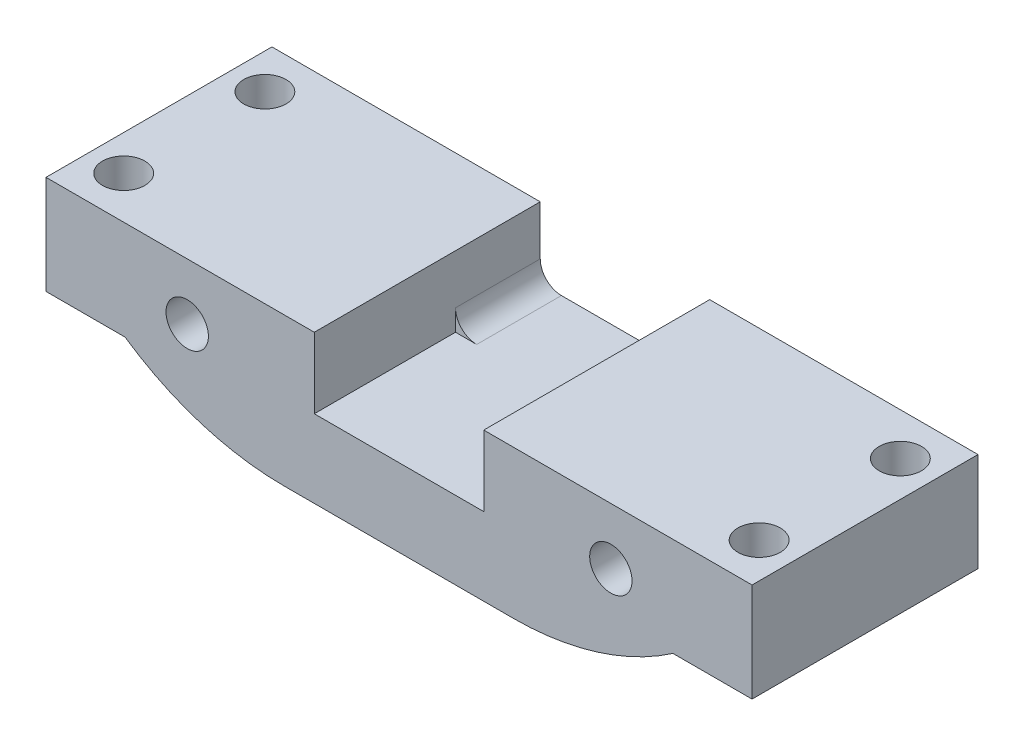
ISO-10303-21;
HEADER;
FILE_DESCRIPTION(('STEP AP214'),'2;1');
FILE_NAME('part.step','',(''),(''),'','','');
FILE_SCHEMA(('AUTOMOTIVE_DESIGN { 1 0 10303 214 1 1 1 1 }'));
ENDSEC;
DATA;
#1=APPLICATION_CONTEXT('core data for automotive mechanical design processes');
#2=APPLICATION_PROTOCOL_DEFINITION('international standard','automotive_design',2000,#1);
#3=PRODUCT_CONTEXT('',#1,'mechanical');
#4=PRODUCT('Part','Part','',(#3));
#5=PRODUCT_RELATED_PRODUCT_CATEGORY('part','',(#4));
#6=PRODUCT_DEFINITION_FORMATION('','',#4);
#7=PRODUCT_DEFINITION_CONTEXT('part definition',#1,'design');
#8=PRODUCT_DEFINITION('design','',#6,#7);
#9=PRODUCT_DEFINITION_SHAPE('','',#8);
#10=(LENGTH_UNIT() NAMED_UNIT(*) SI_UNIT(.MILLI.,.METRE.));
#11=(NAMED_UNIT(*) PLANE_ANGLE_UNIT() SI_UNIT($,.RADIAN.));
#12=(NAMED_UNIT(*) SI_UNIT($,.STERADIAN.) SOLID_ANGLE_UNIT());
#13=UNCERTAINTY_MEASURE_WITH_UNIT(LENGTH_MEASURE(1.E-05),#10,'distance_accuracy_value','');
#14=(GEOMETRIC_REPRESENTATION_CONTEXT(3) GLOBAL_UNCERTAINTY_ASSIGNED_CONTEXT((#13)) GLOBAL_UNIT_ASSIGNED_CONTEXT((#10,
#11,#12)) REPRESENTATION_CONTEXT('',''));
#15=CARTESIAN_POINT('',(0.,0.,0.));
#16=DIRECTION('',(0.,0.,1.));
#17=DIRECTION('',(1.,0.,0.));
#18=AXIS2_PLACEMENT_3D('',#15,#16,#17);
#19=CARTESIAN_POINT('',(0.,14.9,10.));
#20=DIRECTION('',(0.,1.,0.));
#21=DIRECTION('',(-1.,0.,0.));
#22=AXIS2_PLACEMENT_3D('',#19,#20,#21);
#23=PLANE('',#22);
#24=CARTESIAN_POINT('',(45.5,14.9,7.));
#25=DIRECTION('',(0.,1.,0.));
#26=DIRECTION('',(-1.,0.,0.));
#27=AXIS2_PLACEMENT_3D('',#24,#25,#26);
#28=CIRCLE('',#27,1.5);
#29=CARTESIAN_POINT('',(44.,14.9,7.));
#30=VERTEX_POINT('',#29);
#31=EDGE_CURVE('E297',#30,#30,#28,.T.);
#32=ORIENTED_EDGE('',*,*,#31,.F.);
#33=EDGE_LOOP('',(#32));
#34=FACE_BOUND('',#33,.T.);
#35=CARTESIAN_POINT('',(45.4999999999999,14.9,-3.00000000000001));
#36=DIRECTION('',(0.,1.,0.));
#37=DIRECTION('',(-1.,0.,0.));
#38=AXIS2_PLACEMENT_3D('',#35,#36,#37);
#39=CIRCLE('',#38,1.5);
#40=CARTESIAN_POINT('',(43.9999999999999,14.9,-3.00000000000001));
#41=VERTEX_POINT('',#40);
#42=EDGE_CURVE('E294',#41,#41,#39,.T.);
#43=ORIENTED_EDGE('',*,*,#42,.F.);
#44=EDGE_LOOP('',(#43));
#45=FACE_BOUND('',#44,.T.);
#46=DIRECTION('',(0.,0.,-1.));
#47=VECTOR('',#46,1.);
#48=CARTESIAN_POINT('',(48.,14.9,10.));
#49=LINE('',#48,#47);
#50=CARTESIAN_POINT('',(48.,14.9,10.));
#51=VERTEX_POINT('',#50);
#52=CARTESIAN_POINT('',(48.,14.9,-6.));
#53=VERTEX_POINT('',#52);
#54=EDGE_CURVE('E166',#51,#53,#49,.T.);
#55=ORIENTED_EDGE('',*,*,#54,.T.);
#56=DIRECTION('',(1.,0.,0.));
#57=VECTOR('',#56,1.);
#58=CARTESIAN_POINT('',(29.,14.9,-6.));
#59=LINE('',#58,#57);
#60=CARTESIAN_POINT('',(29.,14.9,-6.));
#61=VERTEX_POINT('',#60);
#62=EDGE_CURVE('E182',#61,#53,#59,.T.);
#63=ORIENTED_EDGE('',*,*,#62,.F.);
#64=DIRECTION('',(0.,0.,-1.));
#65=VECTOR('',#64,1.);
#66=CARTESIAN_POINT('',(29.,14.9,10.));
#67=LINE('',#66,#65);
#68=CARTESIAN_POINT('',(29.,14.9,10.));
#69=VERTEX_POINT('',#68);
#70=EDGE_CURVE('E285',#69,#61,#67,.T.);
#71=ORIENTED_EDGE('',*,*,#70,.F.);
#72=DIRECTION('',(1.,0.,0.));
#73=VECTOR('',#72,1.);
#74=CARTESIAN_POINT('',(0.,14.9,10.));
#75=LINE('',#74,#73);
#76=EDGE_CURVE('E239',#69,#51,#75,.T.);
#77=ORIENTED_EDGE('',*,*,#76,.T.);
#78=EDGE_LOOP('',(#55,#63,#71,#77));
#79=FACE_BOUND('',#78,.T.);
#80=ADVANCED_FACE('F41',(#34,#45,#79),#23,.T.);
#81=CARTESIAN_POINT('',(29.,0.,10.));
#82=DIRECTION('',(1.,0.,0.));
#83=DIRECTION('',(0.,0.,-1.));
#84=AXIS2_PLACEMENT_3D('',#81,#82,#83);
#85=PLANE('',#84);
#86=ORIENTED_EDGE('',*,*,#70,.T.);
#87=DIRECTION('',(0.,1.,0.));
#88=VECTOR('',#87,1.);
#89=CARTESIAN_POINT('',(29.,11.4,-6.));
#90=LINE('',#89,#88);
#91=CARTESIAN_POINT('',(29.,11.4,-6.));
#92=VERTEX_POINT('',#91);
#93=EDGE_CURVE('E216',#92,#61,#90,.T.);
#94=ORIENTED_EDGE('',*,*,#93,.F.);
#95=DIRECTION('',(0.,0.,1.));
#96=VECTOR('',#95,1.);
#97=CARTESIAN_POINT('',(29.,11.4,-6.));
#98=LINE('',#97,#96);
#99=CARTESIAN_POINT('',(29.,11.4,0.));
#100=VERTEX_POINT('',#99);
#101=EDGE_CURVE('E219',#92,#100,#98,.T.);
#102=ORIENTED_EDGE('',*,*,#101,.T.);
#103=DIRECTION('',(0.,-1.,0.));
#104=VECTOR('',#103,1.);
#105=CARTESIAN_POINT('',(29.,0.,0.));
#106=LINE('',#105,#104);
#107=CARTESIAN_POINT('',(29.,9.9,0.));
#108=VERTEX_POINT('',#107);
#109=EDGE_CURVE('E231',#100,#108,#106,.T.);
#110=ORIENTED_EDGE('',*,*,#109,.T.);
#111=DIRECTION('',(0.,0.,-1.));
#112=VECTOR('',#111,1.);
#113=CARTESIAN_POINT('',(29.,9.9,10.));
#114=LINE('',#113,#112);
#115=CARTESIAN_POINT('',(29.,9.9,10.));
#116=VERTEX_POINT('',#115);
#117=EDGE_CURVE('E282',#116,#108,#114,.T.);
#118=ORIENTED_EDGE('',*,*,#117,.F.);
#119=DIRECTION('',(0.,-1.,0.));
#120=VECTOR('',#119,1.);
#121=CARTESIAN_POINT('',(29.,0.,10.));
#122=LINE('',#121,#120);
#123=EDGE_CURVE('E242',#69,#116,#122,.T.);
#124=ORIENTED_EDGE('',*,*,#123,.F.);
#125=EDGE_LOOP('',(#86,#94,#102,#110,#118,#124));
#126=FACE_BOUND('',#125,.T.);
#127=ADVANCED_FACE('F338',(#126),#85,.F.);
#128=CARTESIAN_POINT('',(0.,9.9,10.));
#129=DIRECTION('',(0.,1.,0.));
#130=DIRECTION('',(0.,0.,1.));
#131=AXIS2_PLACEMENT_3D('',#128,#129,#130);
#132=PLANE('',#131);
#133=DIRECTION('',(1.,0.,0.));
#134=VECTOR('',#133,1.);
#135=CARTESIAN_POINT('',(0.,9.9,0.));
#136=LINE('',#135,#134);
#137=CARTESIAN_POINT('',(17.,9.9,0.));
#138=VERTEX_POINT('',#137);
#139=CARTESIAN_POINT('',(18.5,9.9,0.));
#140=VERTEX_POINT('',#139);
#141=EDGE_CURVE('E266',#138,#140,#136,.T.);
#142=ORIENTED_EDGE('',*,*,#141,.F.);
#143=DIRECTION('',(0.,0.,-1.));
#144=VECTOR('',#143,1.);
#145=CARTESIAN_POINT('',(17.,9.9,10.));
#146=LINE('',#145,#144);
#147=CARTESIAN_POINT('',(17.,9.9,10.));
#148=VERTEX_POINT('',#147);
#149=EDGE_CURVE('E279',#148,#138,#146,.T.);
#150=ORIENTED_EDGE('',*,*,#149,.F.);
#151=DIRECTION('',(1.,0.,0.));
#152=VECTOR('',#151,1.);
#153=CARTESIAN_POINT('',(0.,9.9,10.));
#154=LINE('',#153,#152);
#155=EDGE_CURVE('E244',#148,#116,#154,.T.);
#156=ORIENTED_EDGE('',*,*,#155,.T.);
#157=ORIENTED_EDGE('',*,*,#117,.T.);
#158=CARTESIAN_POINT('',(27.5,9.9,0.));
#159=VERTEX_POINT('',#158);
#160=EDGE_CURVE('E265',#159,#108,#136,.T.);
#161=ORIENTED_EDGE('',*,*,#160,.F.);
#162=DIRECTION('',(0.,0.,1.));
#163=VECTOR('',#162,1.);
#164=CARTESIAN_POINT('',(27.5,9.9,-6.));
#165=LINE('',#164,#163);
#166=CARTESIAN_POINT('',(27.5,9.9,-6.));
#167=VERTEX_POINT('',#166);
#168=EDGE_CURVE('E224',#167,#159,#165,.T.);
#169=ORIENTED_EDGE('',*,*,#168,.F.);
#170=DIRECTION('',(1.,0.,0.));
#171=VECTOR('',#170,1.);
#172=CARTESIAN_POINT('',(18.5,9.9,-6.));
#173=LINE('',#172,#171);
#174=CARTESIAN_POINT('',(18.5,9.9,-6.));
#175=VERTEX_POINT('',#174);
#176=EDGE_CURVE('E212',#175,#167,#173,.T.);
#177=ORIENTED_EDGE('',*,*,#176,.F.);
#178=DIRECTION('',(0.,0.,1.));
#179=VECTOR('',#178,1.);
#180=CARTESIAN_POINT('',(18.5,9.9,-6.));
#181=LINE('',#180,#179);
#182=EDGE_CURVE('E226',#175,#140,#181,.T.);
#183=ORIENTED_EDGE('',*,*,#182,.T.);
#184=EDGE_LOOP('',(#142,#150,#156,#157,#161,#169,#177,#183));
#185=FACE_BOUND('',#184,.T.);
#186=ADVANCED_FACE('F344',(#185),#132,.T.);
#187=CARTESIAN_POINT('',(17.,0.,10.));
#188=DIRECTION('',(1.,0.,0.));
#189=DIRECTION('',(0.,0.,-1.));
#190=AXIS2_PLACEMENT_3D('',#187,#188,#189);
#191=PLANE('',#190);
#192=DIRECTION('',(0.,-1.,0.));
#193=VECTOR('',#192,1.);
#194=CARTESIAN_POINT('',(17.,0.,0.));
#195=LINE('',#194,#193);
#196=CARTESIAN_POINT('',(17.,11.4,0.));
#197=VERTEX_POINT('',#196);
#198=EDGE_CURVE('E236',#197,#138,#195,.T.);
#199=ORIENTED_EDGE('',*,*,#198,.F.);
#200=DIRECTION('',(0.,0.,1.));
#201=VECTOR('',#200,1.);
#202=CARTESIAN_POINT('',(17.,11.4,-6.));
#203=LINE('',#202,#201);
#204=CARTESIAN_POINT('',(17.,11.4,-6.));
#205=VERTEX_POINT('',#204);
#206=EDGE_CURVE('E229',#205,#197,#203,.T.);
#207=ORIENTED_EDGE('',*,*,#206,.F.);
#208=DIRECTION('',(0.,-1.,0.));
#209=VECTOR('',#208,1.);
#210=CARTESIAN_POINT('',(17.,14.9,-6.));
#211=LINE('',#210,#209);
#212=CARTESIAN_POINT('',(17.,14.9,-6.));
#213=VERTEX_POINT('',#212);
#214=EDGE_CURVE('E208',#213,#205,#211,.T.);
#215=ORIENTED_EDGE('',*,*,#214,.F.);
#216=DIRECTION('',(0.,0.,-1.));
#217=VECTOR('',#216,1.);
#218=CARTESIAN_POINT('',(17.,14.9,10.));
#219=LINE('',#218,#217);
#220=CARTESIAN_POINT('',(17.,14.9,10.));
#221=VERTEX_POINT('',#220);
#222=EDGE_CURVE('E277',#221,#213,#219,.T.);
#223=ORIENTED_EDGE('',*,*,#222,.F.);
#224=DIRECTION('',(0.,-1.,0.));
#225=VECTOR('',#224,1.);
#226=CARTESIAN_POINT('',(17.,0.,10.));
#227=LINE('',#226,#225);
#228=EDGE_CURVE('E247',#221,#148,#227,.T.);
#229=ORIENTED_EDGE('',*,*,#228,.T.);
#230=ORIENTED_EDGE('',*,*,#149,.T.);
#231=EDGE_LOOP('',(#199,#207,#215,#223,#229,#230));
#232=FACE_BOUND('',#231,.T.);
#233=ADVANCED_FACE('F387',(#232),#191,.T.);
#234=CARTESIAN_POINT('',(0.,14.9,10.));
#235=DIRECTION('',(0.,1.,0.));
#236=DIRECTION('',(-1.,0.,0.));
#237=AXIS2_PLACEMENT_3D('',#234,#235,#236);
#238=PLANE('',#237);
#239=CARTESIAN_POINT('',(0.499999999999979,14.9,-3.));
#240=DIRECTION('',(0.,1.,0.));
#241=DIRECTION('',(-1.,0.,0.));
#242=AXIS2_PLACEMENT_3D('',#239,#240,#241);
#243=CIRCLE('',#242,1.5);
#244=CARTESIAN_POINT('',(-1.00000000000002,14.9,-3.));
#245=VERTEX_POINT('',#244);
#246=EDGE_CURVE('E311',#245,#245,#243,.T.);
#247=ORIENTED_EDGE('',*,*,#246,.F.);
#248=EDGE_LOOP('',(#247));
#249=FACE_BOUND('',#248,.T.);
#250=CARTESIAN_POINT('',(0.499999999999975,14.9,7.));
#251=DIRECTION('',(0.,1.,0.));
#252=DIRECTION('',(-1.,0.,0.));
#253=AXIS2_PLACEMENT_3D('',#250,#251,#252);
#254=CIRCLE('',#253,1.5);
#255=CARTESIAN_POINT('',(-1.00000000000002,14.9,7.));
#256=VERTEX_POINT('',#255);
#257=EDGE_CURVE('E300',#256,#256,#254,.T.);
#258=ORIENTED_EDGE('',*,*,#257,.F.);
#259=EDGE_LOOP('',(#258));
#260=FACE_BOUND('',#259,.T.);
#261=ORIENTED_EDGE('',*,*,#222,.T.);
#262=DIRECTION('',(1.,0.,0.));
#263=VECTOR('',#262,1.);
#264=CARTESIAN_POINT('',(-2.00000000000002,14.9,-6.));
#265=LINE('',#264,#263);
#266=CARTESIAN_POINT('',(-2.00000000000002,14.9,-6.));
#267=VERTEX_POINT('',#266);
#268=EDGE_CURVE('E205',#267,#213,#265,.T.);
#269=ORIENTED_EDGE('',*,*,#268,.F.);
#270=DIRECTION('',(0.,0.,-1.));
#271=VECTOR('',#270,1.);
#272=CARTESIAN_POINT('',(-2.00000000000002,14.9,10.));
#273=LINE('',#272,#271);
#274=CARTESIAN_POINT('',(-2.00000000000002,14.9,10.));
#275=VERTEX_POINT('',#274);
#276=EDGE_CURVE('E275',#275,#267,#273,.T.);
#277=ORIENTED_EDGE('',*,*,#276,.F.);
#278=DIRECTION('',(1.,0.,0.));
#279=VECTOR('',#278,1.);
#280=CARTESIAN_POINT('',(0.,14.9,10.));
#281=LINE('',#280,#279);
#282=EDGE_CURVE('E250',#275,#221,#281,.T.);
#283=ORIENTED_EDGE('',*,*,#282,.T.);
#284=EDGE_LOOP('',(#261,#269,#277,#283));
#285=FACE_BOUND('',#284,.T.);
#286=ADVANCED_FACE('F383',(#249,#260,#285),#238,.T.);
#287=CARTESIAN_POINT('',(-2.00000000000002,0.,10.));
#288=DIRECTION('',(1.,0.,0.));
#289=DIRECTION('',(0.,1.,0.));
#290=AXIS2_PLACEMENT_3D('',#287,#288,#289);
#291=PLANE('',#290);
#292=ORIENTED_EDGE('',*,*,#276,.T.);
#293=DIRECTION('',(0.,1.,0.));
#294=VECTOR('',#293,1.);
#295=CARTESIAN_POINT('',(-2.00000000000002,7.9,-6.));
#296=LINE('',#295,#294);
#297=CARTESIAN_POINT('',(-2.00000000000002,7.9,-6.));
#298=VERTEX_POINT('',#297);
#299=EDGE_CURVE('E202',#298,#267,#296,.T.);
#300=ORIENTED_EDGE('',*,*,#299,.F.);
#301=DIRECTION('',(0.,0.,-1.));
#302=VECTOR('',#301,1.);
#303=CARTESIAN_POINT('',(-2.00000000000002,7.9,10.));
#304=LINE('',#303,#302);
#305=CARTESIAN_POINT('',(-2.00000000000002,7.9,10.));
#306=VERTEX_POINT('',#305);
#307=EDGE_CURVE('E273',#306,#298,#304,.T.);
#308=ORIENTED_EDGE('',*,*,#307,.F.);
#309=DIRECTION('',(0.,-1.,0.));
#310=VECTOR('',#309,1.);
#311=CARTESIAN_POINT('',(-2.00000000000002,0.,10.));
#312=LINE('',#311,#310);
#313=EDGE_CURVE('E253',#275,#306,#312,.T.);
#314=ORIENTED_EDGE('',*,*,#313,.F.);
#315=EDGE_LOOP('',(#292,#300,#308,#314));
#316=FACE_BOUND('',#315,.T.);
#317=ADVANCED_FACE('F378',(#316),#291,.F.);
#318=CARTESIAN_POINT('',(0.,7.9,10.));
#319=DIRECTION('',(0.,-1.,0.));
#320=DIRECTION('',(0.,0.,-1.));
#321=AXIS2_PLACEMENT_3D('',#318,#319,#320);
#322=PLANE('',#321);
#323=CARTESIAN_POINT('',(0.499999999999981,7.9,-3.));
#324=DIRECTION('',(0.,-1.,0.));
#325=DIRECTION('',(0.,0.,-1.));
#326=AXIS2_PLACEMENT_3D('',#323,#324,#325);
#327=CIRCLE('',#326,1.5);
#328=CARTESIAN_POINT('',(0.499999999999981,7.9,-4.5));
#329=VERTEX_POINT('',#328);
#330=EDGE_CURVE('E45',#329,#329,#327,.T.);
#331=ORIENTED_EDGE('',*,*,#330,.F.);
#332=EDGE_LOOP('',(#331));
#333=FACE_BOUND('',#332,.T.);
#334=CARTESIAN_POINT('',(0.499999999999977,7.9,7.));
#335=DIRECTION('',(0.,-1.,0.));
#336=DIRECTION('',(0.,0.,-1.));
#337=AXIS2_PLACEMENT_3D('',#334,#335,#336);
#338=CIRCLE('',#337,1.5);
#339=CARTESIAN_POINT('',(0.499999999999977,7.9,5.5));
#340=VERTEX_POINT('',#339);
#341=EDGE_CURVE('E298',#340,#340,#338,.T.);
#342=ORIENTED_EDGE('',*,*,#341,.F.);
#343=EDGE_LOOP('',(#342));
#344=FACE_BOUND('',#343,.T.);
#345=ORIENTED_EDGE('',*,*,#307,.T.);
#346=DIRECTION('',(-1.,0.,0.));
#347=VECTOR('',#346,1.);
#348=CARTESIAN_POINT('',(3.5980762113533,7.90000000000001,-6.));
#349=LINE('',#348,#347);
#350=CARTESIAN_POINT('',(3.5980762113533,7.90000000000001,-6.));
#351=VERTEX_POINT('',#350);
#352=EDGE_CURVE('E199',#351,#298,#349,.T.);
#353=ORIENTED_EDGE('',*,*,#352,.F.);
#354=DIRECTION('',(0.,0.,-1.));
#355=VECTOR('',#354,1.);
#356=CARTESIAN_POINT('',(3.5980762113533,7.9,10.));
#357=LINE('',#356,#355);
#358=CARTESIAN_POINT('',(3.5980762113533,7.9,10.));
#359=VERTEX_POINT('',#358);
#360=EDGE_CURVE('E271',#359,#351,#357,.T.);
#361=ORIENTED_EDGE('',*,*,#360,.F.);
#362=DIRECTION('',(-1.,0.,0.));
#363=VECTOR('',#362,1.);
#364=CARTESIAN_POINT('',(0.,7.9,10.));
#365=LINE('',#364,#363);
#366=EDGE_CURVE('E255',#359,#306,#365,.T.);
#367=ORIENTED_EDGE('',*,*,#366,.T.);
#368=EDGE_LOOP('',(#345,#353,#361,#367));
#369=FACE_BOUND('',#368,.T.);
#370=ADVANCED_FACE('F374',(#333,#344,#369),#322,.T.);
#371=CARTESIAN_POINT('',(0.,4.4,10.));
#372=DIRECTION('',(0.,1.,0.));
#373=DIRECTION('',(-1.,0.,0.));
#374=AXIS2_PLACEMENT_3D('',#371,#372,#373);
#375=PLANE('',#374);
#376=DIRECTION('',(0.,0.,-1.));
#377=VECTOR('',#376,1.);
#378=CARTESIAN_POINT('',(14.9007307668106,4.40000000000001,10.));
#379=LINE('',#378,#377);
#380=CARTESIAN_POINT('',(14.9007307668106,4.40000000000001,10.));
#381=VERTEX_POINT('',#380);
#382=CARTESIAN_POINT('',(14.9007307668106,4.40000000000001,-6.));
#383=VERTEX_POINT('',#382);
#384=EDGE_CURVE('E287',#381,#383,#379,.T.);
#385=ORIENTED_EDGE('',*,*,#384,.T.);
#386=DIRECTION('',(-1.,0.,0.));
#387=VECTOR('',#386,1.);
#388=CARTESIAN_POINT('',(31.0973454445427,4.40000000000001,-6.));
#389=LINE('',#388,#387);
#390=CARTESIAN_POINT('',(31.0973454445427,4.40000000000001,-6.));
#391=VERTEX_POINT('',#390);
#392=EDGE_CURVE('E193',#391,#383,#389,.T.);
#393=ORIENTED_EDGE('',*,*,#392,.F.);
#394=DIRECTION('',(0.,0.,-1.));
#395=VECTOR('',#394,1.);
#396=CARTESIAN_POINT('',(31.0973454445427,4.40000000000001,10.));
#397=LINE('',#396,#395);
#398=CARTESIAN_POINT('',(31.0973454445427,4.40000000000001,10.));
#399=VERTEX_POINT('',#398);
#400=EDGE_CURVE('E58',#391,#399,#397,.F.);
#401=ORIENTED_EDGE('',*,*,#400,.T.);
#402=DIRECTION('',(1.,0.,0.));
#403=VECTOR('',#402,1.);
#404=CARTESIAN_POINT('',(0.,4.4,10.));
#405=LINE('',#404,#403);
#406=EDGE_CURVE('E258',#381,#399,#405,.T.);
#407=ORIENTED_EDGE('',*,*,#406,.F.);
#408=EDGE_LOOP('',(#385,#393,#401,#407));
#409=FACE_BOUND('',#408,.T.);
#410=ADVANCED_FACE('F369',(#409),#375,.F.);
#411=CARTESIAN_POINT('',(0.,7.9,10.));
#412=DIRECTION('',(0.,-1.,0.));
#413=DIRECTION('',(1.,0.,0.));
#414=AXIS2_PLACEMENT_3D('',#411,#412,#413);
#415=PLANE('',#414);
#416=CARTESIAN_POINT('',(45.5,7.90000000000001,7.));
#417=DIRECTION('',(0.,-1.,0.));
#418=DIRECTION('',(1.,0.,0.));
#419=AXIS2_PLACEMENT_3D('',#416,#417,#418);
#420=CIRCLE('',#419,1.5);
#421=CARTESIAN_POINT('',(47.,7.90000000000001,7.));
#422=VERTEX_POINT('',#421);
#423=EDGE_CURVE('E295',#422,#422,#420,.T.);
#424=ORIENTED_EDGE('',*,*,#423,.F.);
#425=EDGE_LOOP('',(#424));
#426=FACE_BOUND('',#425,.T.);
#427=CARTESIAN_POINT('',(45.4999999999999,7.90000000000001,-3.00000000000001));
#428=DIRECTION('',(0.,-1.,0.));
#429=DIRECTION('',(1.,0.,0.));
#430=AXIS2_PLACEMENT_3D('',#427,#428,#429);
#431=CIRCLE('',#430,1.5);
#432=CARTESIAN_POINT('',(46.9999999999999,7.90000000000001,-3.00000000000001));
#433=VERTEX_POINT('',#432);
#434=EDGE_CURVE('E291',#433,#433,#431,.T.);
#435=ORIENTED_EDGE('',*,*,#434,.F.);
#436=EDGE_LOOP('',(#435));
#437=FACE_BOUND('',#436,.T.);
#438=DIRECTION('',(0.,0.,-1.));
#439=VECTOR('',#438,1.);
#440=CARTESIAN_POINT('',(42.4,7.90000000000001,10.));
#441=LINE('',#440,#439);
#442=CARTESIAN_POINT('',(42.4,7.90000000000001,10.));
#443=VERTEX_POINT('',#442);
#444=CARTESIAN_POINT('',(42.4,7.90000000000001,-6.));
#445=VERTEX_POINT('',#444);
#446=EDGE_CURVE('E165',#443,#445,#441,.T.);
#447=ORIENTED_EDGE('',*,*,#446,.T.);
#448=DIRECTION('',(-1.,0.,0.));
#449=VECTOR('',#448,1.);
#450=CARTESIAN_POINT('',(48.,7.90000000000001,-6.));
#451=LINE('',#450,#449);
#452=CARTESIAN_POINT('',(48.,7.90000000000001,-6.));
#453=VERTEX_POINT('',#452);
#454=EDGE_CURVE('E169',#453,#445,#451,.T.);
#455=ORIENTED_EDGE('',*,*,#454,.F.);
#456=DIRECTION('',(0.,0.,-1.));
#457=VECTOR('',#456,1.);
#458=CARTESIAN_POINT('',(48.,7.90000000000001,10.));
#459=LINE('',#458,#457);
#460=CARTESIAN_POINT('',(48.,7.90000000000001,10.));
#461=VERTEX_POINT('',#460);
#462=EDGE_CURVE('E155',#461,#453,#459,.T.);
#463=ORIENTED_EDGE('',*,*,#462,.F.);
#464=DIRECTION('',(-1.,0.,0.));
#465=VECTOR('',#464,1.);
#466=CARTESIAN_POINT('',(0.,7.9,10.));
#467=LINE('',#466,#465);
#468=EDGE_CURVE('E260',#461,#443,#467,.T.);
#469=ORIENTED_EDGE('',*,*,#468,.T.);
#470=EDGE_LOOP('',(#447,#455,#463,#469));
#471=FACE_BOUND('',#470,.T.);
#472=ADVANCED_FACE('F170',(#426,#437,#471),#415,.T.);
#473=CARTESIAN_POINT('',(7.99999999999999,10.9,10.));
#474=DIRECTION('',(0.,0.,-1.));
#475=DIRECTION('',(-1.,0.,0.));
#476=AXIS2_PLACEMENT_3D('',#473,#474,#475);
#477=CYLINDRICAL_SURFACE('',#476,1.5);
#478=CARTESIAN_POINT('',(7.99999999999999,10.9,10.));
#479=DIRECTION('',(0.,0.,1.));
#480=DIRECTION('',(1.,0.,0.));
#481=AXIS2_PLACEMENT_3D('',#478,#479,#480);
#482=CIRCLE('',#481,1.5);
#483=CARTESIAN_POINT('',(9.49999999999998,10.9,10.));
#484=VERTEX_POINT('',#483);
#485=EDGE_CURVE('E235',#484,#484,#482,.T.);
#486=ORIENTED_EDGE('',*,*,#485,.T.);
#487=EDGE_LOOP('',(#486));
#488=FACE_BOUND('',#487,.T.);
#489=CARTESIAN_POINT('',(7.99999999999999,10.9,-6.));
#490=DIRECTION('',(0.,0.,-1.));
#491=DIRECTION('',(-1.,0.,0.));
#492=AXIS2_PLACEMENT_3D('',#489,#490,#491);
#493=CIRCLE('',#492,1.5);
#494=CARTESIAN_POINT('',(6.49999999999999,10.9,-6.));
#495=VERTEX_POINT('',#494);
#496=EDGE_CURVE('E313',#495,#495,#493,.T.);
#497=ORIENTED_EDGE('',*,*,#496,.T.);
#498=EDGE_LOOP('',(#497));
#499=FACE_BOUND('',#498,.T.);
#500=ADVANCED_FACE('F350',(#488,#499),#477,.F.);
#501=CARTESIAN_POINT('',(38.,10.9,10.));
#502=DIRECTION('',(0.,0.,-1.));
#503=DIRECTION('',(-1.,0.,0.));
#504=AXIS2_PLACEMENT_3D('',#501,#502,#503);
#505=CYLINDRICAL_SURFACE('',#504,1.5);
#506=CARTESIAN_POINT('',(38.,10.9,10.));
#507=DIRECTION('',(0.,0.,1.));
#508=DIRECTION('',(1.,0.,0.));
#509=AXIS2_PLACEMENT_3D('',#506,#507,#508);
#510=CIRCLE('',#509,1.5);
#511=CARTESIAN_POINT('',(39.5,10.9,10.));
#512=VERTEX_POINT('',#511);
#513=EDGE_CURVE('E232',#512,#512,#510,.T.);
#514=ORIENTED_EDGE('',*,*,#513,.T.);
#515=EDGE_LOOP('',(#514));
#516=FACE_BOUND('',#515,.T.);
#517=CARTESIAN_POINT('',(38.,10.9,-6.));
#518=DIRECTION('',(0.,0.,-1.));
#519=DIRECTION('',(-1.,0.,0.));
#520=AXIS2_PLACEMENT_3D('',#517,#518,#519);
#521=CIRCLE('',#520,1.5);
#522=CARTESIAN_POINT('',(36.5,10.9,-6.));
#523=VERTEX_POINT('',#522);
#524=EDGE_CURVE('E189',#523,#523,#521,.T.);
#525=ORIENTED_EDGE('',*,*,#524,.T.);
#526=EDGE_LOOP('',(#525));
#527=FACE_BOUND('',#526,.T.);
#528=ADVANCED_FACE('F320',(#516,#527),#505,.F.);
#529=CARTESIAN_POINT('',(48.,0.,10.));
#530=DIRECTION('',(1.,0.,0.));
#531=DIRECTION('',(0.,1.,0.));
#532=AXIS2_PLACEMENT_3D('',#529,#530,#531);
#533=PLANE('',#532);
#534=ORIENTED_EDGE('',*,*,#462,.T.);
#535=DIRECTION('',(0.,-1.,0.));
#536=VECTOR('',#535,1.);
#537=CARTESIAN_POINT('',(48.,14.9,-6.));
#538=LINE('',#537,#536);
#539=EDGE_CURVE('E159',#53,#453,#538,.T.);
#540=ORIENTED_EDGE('',*,*,#539,.F.);
#541=ORIENTED_EDGE('',*,*,#54,.F.);
#542=DIRECTION('',(0.,-1.,0.));
#543=VECTOR('',#542,1.);
#544=CARTESIAN_POINT('',(48.,0.,10.));
#545=LINE('',#544,#543);
#546=EDGE_CURVE('E161',#51,#461,#545,.T.);
#547=ORIENTED_EDGE('',*,*,#546,.T.);
#548=EDGE_LOOP('',(#534,#540,#541,#547));
#549=FACE_BOUND('',#548,.T.);
#550=ADVANCED_FACE('F157',(#549),#533,.T.);
#551=CARTESIAN_POINT('',(0.,0.,10.));
#552=DIRECTION('',(0.,0.,1.));
#553=DIRECTION('',(1.,0.,0.));
#554=AXIS2_PLACEMENT_3D('',#551,#552,#553);
#555=PLANE('',#554);
#556=ORIENTED_EDGE('',*,*,#513,.F.);
#557=EDGE_LOOP('',(#556));
#558=FACE_BOUND('',#557,.T.);
#559=ORIENTED_EDGE('',*,*,#485,.F.);
#560=EDGE_LOOP('',(#559));
#561=FACE_BOUND('',#560,.T.);
#562=ORIENTED_EDGE('',*,*,#406,.T.);
#563=CARTESIAN_POINT('',(31.0973454445427,24.4,10.));
#564=DIRECTION('',(0.,0.,1.));
#565=DIRECTION('',(1.,0.,0.));
#566=AXIS2_PLACEMENT_3D('',#563,#564,#565);
#567=CIRCLE('',#566,20.);
#568=EDGE_CURVE('E11',#399,#443,#567,.T.);
#569=ORIENTED_EDGE('',*,*,#568,.T.);
#570=ORIENTED_EDGE('',*,*,#468,.F.);
#571=ORIENTED_EDGE('',*,*,#546,.F.);
#572=ORIENTED_EDGE('',*,*,#76,.F.);
#573=ORIENTED_EDGE('',*,*,#123,.T.);
#574=ORIENTED_EDGE('',*,*,#155,.F.);
#575=ORIENTED_EDGE('',*,*,#228,.F.);
#576=ORIENTED_EDGE('',*,*,#282,.F.);
#577=ORIENTED_EDGE('',*,*,#313,.T.);
#578=ORIENTED_EDGE('',*,*,#366,.F.);
#579=CARTESIAN_POINT('',(14.9007307668106,24.4,10.));
#580=DIRECTION('',(0.,0.,1.));
#581=DIRECTION('',(1.,0.,0.));
#582=AXIS2_PLACEMENT_3D('',#579,#580,#581);
#583=CIRCLE('',#582,20.);
#584=EDGE_CURVE('E50',#359,#381,#583,.T.);
#585=ORIENTED_EDGE('',*,*,#584,.T.);
#586=EDGE_LOOP('',(#562,#569,#570,#571,#572,#573,#574,#575,#576,#577,#578,#585));
#587=FACE_BOUND('',#586,.T.);
#588=ADVANCED_FACE('F358',(#558,#561,#587),#555,.T.);
#589=CARTESIAN_POINT('',(31.0973454445427,24.4,10.));
#590=DIRECTION('',(0.,0.,-1.));
#591=DIRECTION('',(-1.,0.,0.));
#592=AXIS2_PLACEMENT_3D('',#589,#590,#591);
#593=CYLINDRICAL_SURFACE('',#592,20.);
#594=ORIENTED_EDGE('',*,*,#568,.F.);
#595=ORIENTED_EDGE('',*,*,#400,.F.);
#596=CARTESIAN_POINT('',(31.0973454445427,24.4,-6.));
#597=DIRECTION('',(0.,0.,-1.));
#598=DIRECTION('',(-1.,0.,0.));
#599=AXIS2_PLACEMENT_3D('',#596,#597,#598);
#600=CIRCLE('',#599,20.);
#601=EDGE_CURVE('E175',#445,#391,#600,.T.);
#602=ORIENTED_EDGE('',*,*,#601,.F.);
#603=ORIENTED_EDGE('',*,*,#446,.F.);
#604=EDGE_LOOP('',(#594,#595,#602,#603));
#605=FACE_BOUND('',#604,.T.);
#606=ADVANCED_FACE('F356',(#605),#593,.T.);
#607=CARTESIAN_POINT('',(14.9007307668106,24.4,10.));
#608=DIRECTION('',(0.,0.,-1.));
#609=DIRECTION('',(-1.,0.,0.));
#610=AXIS2_PLACEMENT_3D('',#607,#608,#609);
#611=CYLINDRICAL_SURFACE('',#610,20.);
#612=ORIENTED_EDGE('',*,*,#584,.F.);
#613=ORIENTED_EDGE('',*,*,#360,.T.);
#614=CARTESIAN_POINT('',(14.9007307668106,24.4,-6.));
#615=DIRECTION('',(0.,0.,-1.));
#616=DIRECTION('',(-1.,0.,0.));
#617=AXIS2_PLACEMENT_3D('',#614,#615,#616);
#618=CIRCLE('',#617,20.);
#619=EDGE_CURVE('E196',#383,#351,#618,.T.);
#620=ORIENTED_EDGE('',*,*,#619,.F.);
#621=ORIENTED_EDGE('',*,*,#384,.F.);
#622=EDGE_LOOP('',(#612,#613,#620,#621));
#623=FACE_BOUND('',#622,.T.);
#624=ADVANCED_FACE('F43',(#623),#611,.T.);
#625=CARTESIAN_POINT('',(31.0973454445427,24.4,0.));
#626=DIRECTION('',(0.,0.,-1.));
#627=DIRECTION('',(-1.,0.,0.));
#628=AXIS2_PLACEMENT_3D('',#625,#626,#627);
#629=PLANE('',#628);
#630=CARTESIAN_POINT('',(18.5,11.4,0.));
#631=DIRECTION('',(0.,0.,1.));
#632=DIRECTION('',(-1.,0.,0.));
#633=AXIS2_PLACEMENT_3D('',#630,#631,#632);
#634=CIRCLE('',#633,1.5);
#635=EDGE_CURVE('E186',#197,#140,#634,.T.);
#636=ORIENTED_EDGE('',*,*,#635,.F.);
#637=ORIENTED_EDGE('',*,*,#198,.T.);
#638=ORIENTED_EDGE('',*,*,#141,.T.);
#639=EDGE_LOOP('',(#636,#637,#638));
#640=FACE_BOUND('',#639,.T.);
#641=ADVANCED_FACE('F333',(#640),#629,.F.);
#642=CARTESIAN_POINT('',(27.5,11.4,0.));
#643=DIRECTION('',(0.,0.,1.));
#644=DIRECTION('',(-1.,0.,0.));
#645=AXIS2_PLACEMENT_3D('',#642,#643,#644);
#646=CIRCLE('',#645,1.5);
#647=EDGE_CURVE('E183',#159,#100,#646,.T.);
#648=ORIENTED_EDGE('',*,*,#647,.F.);
#649=ORIENTED_EDGE('',*,*,#160,.T.);
#650=ORIENTED_EDGE('',*,*,#109,.F.);
#651=EDGE_LOOP('',(#648,#649,#650));
#652=FACE_BOUND('',#651,.T.);
#653=ADVANCED_FACE('F324',(#652),#629,.F.);
#654=CARTESIAN_POINT('',(31.0973454445427,24.4,-6.));
#655=DIRECTION('',(0.,0.,-1.));
#656=DIRECTION('',(-1.,0.,0.));
#657=AXIS2_PLACEMENT_3D('',#654,#655,#656);
#658=PLANE('',#657);
#659=ORIENTED_EDGE('',*,*,#524,.F.);
#660=EDGE_LOOP('',(#659));
#661=FACE_BOUND('',#660,.T.);
#662=ORIENTED_EDGE('',*,*,#539,.T.);
#663=ORIENTED_EDGE('',*,*,#454,.T.);
#664=ORIENTED_EDGE('',*,*,#601,.T.);
#665=ORIENTED_EDGE('',*,*,#392,.T.);
#666=ORIENTED_EDGE('',*,*,#619,.T.);
#667=ORIENTED_EDGE('',*,*,#352,.T.);
#668=ORIENTED_EDGE('',*,*,#299,.T.);
#669=ORIENTED_EDGE('',*,*,#268,.T.);
#670=ORIENTED_EDGE('',*,*,#214,.T.);
#671=CARTESIAN_POINT('',(18.5,11.4,-6.));
#672=DIRECTION('',(0.,0.,1.));
#673=DIRECTION('',(-1.,0.,0.));
#674=AXIS2_PLACEMENT_3D('',#671,#672,#673);
#675=CIRCLE('',#674,1.5);
#676=EDGE_CURVE('E210',#205,#175,#675,.T.);
#677=ORIENTED_EDGE('',*,*,#676,.T.);
#678=ORIENTED_EDGE('',*,*,#176,.T.);
#679=CARTESIAN_POINT('',(27.5,11.4,-6.));
#680=DIRECTION('',(0.,0.,1.));
#681=DIRECTION('',(-1.,0.,0.));
#682=AXIS2_PLACEMENT_3D('',#679,#680,#681);
#683=CIRCLE('',#682,1.5);
#684=EDGE_CURVE('E214',#167,#92,#683,.T.);
#685=ORIENTED_EDGE('',*,*,#684,.T.);
#686=ORIENTED_EDGE('',*,*,#93,.T.);
#687=ORIENTED_EDGE('',*,*,#62,.T.);
#688=EDGE_LOOP('',(#662,#663,#664,#665,#666,#667,#668,#669,#670,#677,#678,#685,#686,#687));
#689=FACE_BOUND('',#688,.T.);
#690=ORIENTED_EDGE('',*,*,#496,.F.);
#691=EDGE_LOOP('',(#690));
#692=FACE_BOUND('',#691,.T.);
#693=ADVANCED_FACE('F178',(#661,#689,#692),#658,.T.);
#694=CARTESIAN_POINT('',(18.5,11.4,-6.));
#695=DIRECTION('',(0.,0.,1.));
#696=DIRECTION('',(1.,0.,0.));
#697=AXIS2_PLACEMENT_3D('',#694,#695,#696);
#698=CYLINDRICAL_SURFACE('',#697,1.5);
#699=ORIENTED_EDGE('',*,*,#635,.T.);
#700=ORIENTED_EDGE('',*,*,#182,.F.);
#701=ORIENTED_EDGE('',*,*,#676,.F.);
#702=ORIENTED_EDGE('',*,*,#206,.T.);
#703=EDGE_LOOP('',(#699,#700,#701,#702));
#704=FACE_BOUND('',#703,.T.);
#705=ADVANCED_FACE('F323',(#704),#698,.F.);
#706=CARTESIAN_POINT('',(27.5,11.4,-6.));
#707=DIRECTION('',(0.,0.,1.));
#708=DIRECTION('',(1.,0.,0.));
#709=AXIS2_PLACEMENT_3D('',#706,#707,#708);
#710=CYLINDRICAL_SURFACE('',#709,1.5);
#711=ORIENTED_EDGE('',*,*,#647,.T.);
#712=ORIENTED_EDGE('',*,*,#101,.F.);
#713=ORIENTED_EDGE('',*,*,#684,.F.);
#714=ORIENTED_EDGE('',*,*,#168,.T.);
#715=EDGE_LOOP('',(#711,#712,#713,#714));
#716=FACE_BOUND('',#715,.T.);
#717=ADVANCED_FACE('F330',(#716),#710,.F.);
#718=CARTESIAN_POINT('',(45.4999999999999,4.40000000000001,-3.00000000000001));
#719=DIRECTION('',(0.,1.,0.));
#720=DIRECTION('',(-1.,0.,0.));
#721=AXIS2_PLACEMENT_3D('',#718,#719,#720);
#722=CYLINDRICAL_SURFACE('',#721,1.5);
#723=ORIENTED_EDGE('',*,*,#42,.T.);
#724=EDGE_LOOP('',(#723));
#725=FACE_BOUND('',#724,.T.);
#726=ORIENTED_EDGE('',*,*,#434,.T.);
#727=EDGE_LOOP('',(#726));
#728=FACE_BOUND('',#727,.T.);
#729=ADVANCED_FACE('F409',(#725,#728),#722,.F.);
#730=CARTESIAN_POINT('',(45.5,4.40000000000001,7.));
#731=DIRECTION('',(0.,1.,0.));
#732=DIRECTION('',(-1.,0.,0.));
#733=AXIS2_PLACEMENT_3D('',#730,#731,#732);
#734=CYLINDRICAL_SURFACE('',#733,1.5);
#735=ORIENTED_EDGE('',*,*,#31,.T.);
#736=EDGE_LOOP('',(#735));
#737=FACE_BOUND('',#736,.T.);
#738=ORIENTED_EDGE('',*,*,#423,.T.);
#739=EDGE_LOOP('',(#738));
#740=FACE_BOUND('',#739,.T.);
#741=ADVANCED_FACE('F414',(#737,#740),#734,.F.);
#742=CARTESIAN_POINT('',(0.499999999999978,4.39999999999999,7.));
#743=DIRECTION('',(0.,1.,0.));
#744=DIRECTION('',(-1.,0.,0.));
#745=AXIS2_PLACEMENT_3D('',#742,#743,#744);
#746=CYLINDRICAL_SURFACE('',#745,1.5);
#747=ORIENTED_EDGE('',*,*,#257,.T.);
#748=EDGE_LOOP('',(#747));
#749=FACE_BOUND('',#748,.T.);
#750=ORIENTED_EDGE('',*,*,#341,.T.);
#751=EDGE_LOOP('',(#750));
#752=FACE_BOUND('',#751,.T.);
#753=ADVANCED_FACE('F595',(#749,#752),#746,.F.);
#754=CARTESIAN_POINT('',(0.499999999999982,4.39999999999999,-3.));
#755=DIRECTION('',(0.,1.,0.));
#756=DIRECTION('',(-1.,0.,0.));
#757=AXIS2_PLACEMENT_3D('',#754,#755,#756);
#758=CYLINDRICAL_SURFACE('',#757,1.5);
#759=ORIENTED_EDGE('',*,*,#246,.T.);
#760=EDGE_LOOP('',(#759));
#761=FACE_BOUND('',#760,.T.);
#762=ORIENTED_EDGE('',*,*,#330,.T.);
#763=EDGE_LOOP('',(#762));
#764=FACE_BOUND('',#763,.T.);
#765=ADVANCED_FACE('F603',(#761,#764),#758,.F.);
#766=CLOSED_SHELL('',(#80,#127,#186,#233,#286,#317,#370,#410,#472,#500,#528,#550,#588,#606,#624,
#641,#653,#693,#705,#717,#729,#741,#753,#765));
#767=MANIFOLD_SOLID_BREP('B2',#766);
#768=ADVANCED_BREP_SHAPE_REPRESENTATION('',(#18,#767),#14);
#769=SHAPE_DEFINITION_REPRESENTATION(#9,#768);
ENDSEC;
END-ISO-10303-21;
